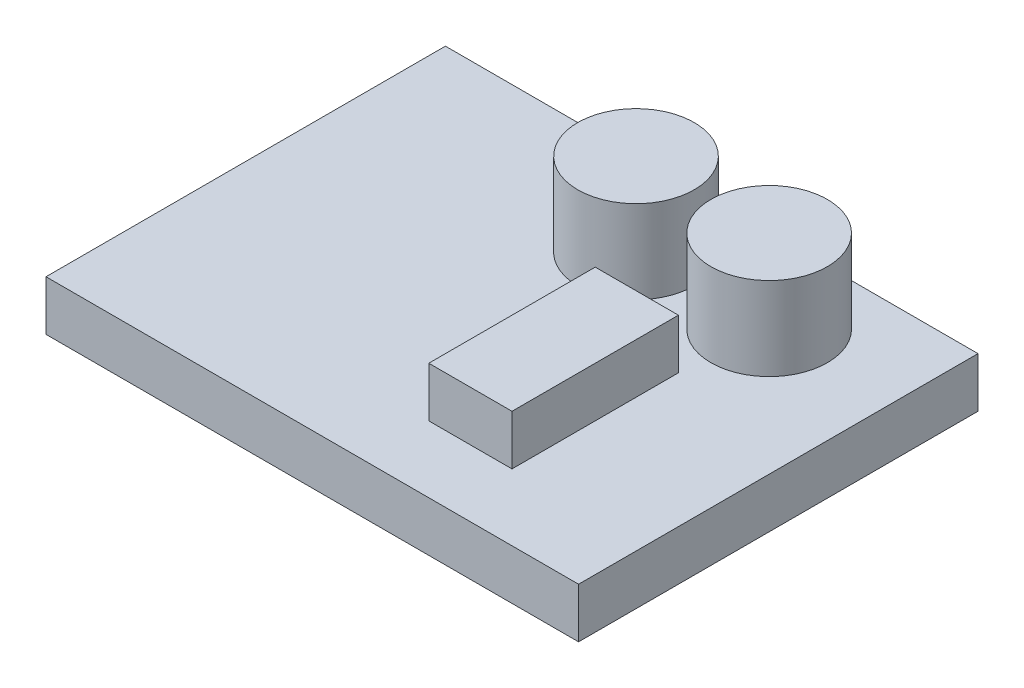
ISO-10303-21;
HEADER;
FILE_DESCRIPTION(('STEP AP214'),'2;1');
FILE_NAME('part.step','',(''),(''),'','','');
FILE_SCHEMA(('AUTOMOTIVE_DESIGN { 1 0 10303 214 1 1 1 1 }'));
ENDSEC;
DATA;
#1=APPLICATION_CONTEXT('core data for automotive mechanical design processes');
#2=APPLICATION_PROTOCOL_DEFINITION('international standard','automotive_design',2000,#1);
#3=PRODUCT_CONTEXT('',#1,'mechanical');
#4=PRODUCT('Part','Part','',(#3));
#5=PRODUCT_RELATED_PRODUCT_CATEGORY('part','',(#4));
#6=PRODUCT_DEFINITION_FORMATION('','',#4);
#7=PRODUCT_DEFINITION_CONTEXT('part definition',#1,'design');
#8=PRODUCT_DEFINITION('design','',#6,#7);
#9=PRODUCT_DEFINITION_SHAPE('','',#8);
#10=(LENGTH_UNIT() NAMED_UNIT(*) SI_UNIT(.MILLI.,.METRE.));
#11=(NAMED_UNIT(*) PLANE_ANGLE_UNIT() SI_UNIT($,.RADIAN.));
#12=(NAMED_UNIT(*) SI_UNIT($,.STERADIAN.) SOLID_ANGLE_UNIT());
#13=UNCERTAINTY_MEASURE_WITH_UNIT(LENGTH_MEASURE(1.E-05),#10,'distance_accuracy_value','');
#14=(GEOMETRIC_REPRESENTATION_CONTEXT(3) GLOBAL_UNCERTAINTY_ASSIGNED_CONTEXT((#13)) GLOBAL_UNIT_ASSIGNED_CONTEXT((#10,
#11,#12)) REPRESENTATION_CONTEXT('',''));
#15=CARTESIAN_POINT('',(0.,0.,0.));
#16=DIRECTION('',(0.,0.,1.));
#17=DIRECTION('',(1.,0.,0.));
#18=AXIS2_PLACEMENT_3D('',#15,#16,#17);
#19=CARTESIAN_POINT('',(0.,3.,0.));
#20=DIRECTION('',(0.,1.,0.));
#21=DIRECTION('',(0.,0.,1.));
#22=AXIS2_PLACEMENT_3D('',#19,#20,#21);
#23=PLANE('',#22);
#24=CARTESIAN_POINT('',(9.07823083781967,3.,-6.52941176470588));
#25=DIRECTION('',(0.,1.,0.));
#26=DIRECTION('',(0.,0.,1.));
#27=AXIS2_PLACEMENT_3D('',#24,#25,#26);
#28=CIRCLE('',#27,3.5);
#29=CARTESIAN_POINT('',(9.07823083781967,3.,-3.02941176470588));
#30=VERTEX_POINT('',#29);
#31=EDGE_CURVE('E132',#30,#30,#28,.T.);
#32=ORIENTED_EDGE('',*,*,#31,.F.);
#33=EDGE_LOOP('',(#32));
#34=FACE_BOUND('',#33,.T.);
#35=DIRECTION('',(0.,0.,1.));
#36=VECTOR('',#35,1.);
#37=CARTESIAN_POINT('',(-15.3725490196078,3.,-11.5294117647059));
#38=LINE('',#37,#36);
#39=CARTESIAN_POINT('',(-15.3725490196078,3.,-11.5294117647059));
#40=VERTEX_POINT('',#39);
#41=CARTESIAN_POINT('',(-15.3725490196078,3.,12.4705882352941));
#42=VERTEX_POINT('',#41);
#43=EDGE_CURVE('E149',#40,#42,#38,.T.);
#44=ORIENTED_EDGE('',*,*,#43,.T.);
#45=DIRECTION('',(1.,0.,0.));
#46=VECTOR('',#45,1.);
#47=CARTESIAN_POINT('',(-15.3725490196078,3.,12.4705882352941));
#48=LINE('',#47,#46);
#49=CARTESIAN_POINT('',(16.6274509803922,3.,12.4705882352941));
#50=VERTEX_POINT('',#49);
#51=EDGE_CURVE('E85',#42,#50,#48,.T.);
#52=ORIENTED_EDGE('',*,*,#51,.T.);
#53=DIRECTION('',(0.,0.,-1.));
#54=VECTOR('',#53,1.);
#55=CARTESIAN_POINT('',(16.6274509803922,3.,-11.5294117647059));
#56=LINE('',#55,#54);
#57=CARTESIAN_POINT('',(16.6274509803922,3.,-11.5294117647059));
#58=VERTEX_POINT('',#57);
#59=EDGE_CURVE('E152',#50,#58,#56,.T.);
#60=ORIENTED_EDGE('',*,*,#59,.T.);
#61=DIRECTION('',(-1.,0.,0.));
#62=VECTOR('',#61,1.);
#63=CARTESIAN_POINT('',(-15.3725490196078,3.,-11.5294117647059));
#64=LINE('',#63,#62);
#65=EDGE_CURVE('E57',#58,#40,#64,.T.);
#66=ORIENTED_EDGE('',*,*,#65,.T.);
#67=EDGE_LOOP('',(#44,#52,#60,#66));
#68=FACE_BOUND('',#67,.T.);
#69=CARTESIAN_POINT('',(1.07823083781967,3.,-6.52941176470588));
#70=DIRECTION('',(0.,1.,0.));
#71=DIRECTION('',(0.,0.,1.));
#72=AXIS2_PLACEMENT_3D('',#69,#70,#71);
#73=CIRCLE('',#72,3.5);
#74=CARTESIAN_POINT('',(1.07823083781967,3.,-3.02941176470588));
#75=VERTEX_POINT('',#74);
#76=EDGE_CURVE('E141',#75,#75,#73,.T.);
#77=ORIENTED_EDGE('',*,*,#76,.F.);
#78=EDGE_LOOP('',(#77));
#79=FACE_BOUND('',#78,.T.);
#80=DIRECTION('',(1.,0.,0.));
#81=VECTOR('',#80,1.);
#82=CARTESIAN_POINT('',(3.62745098039218,3.,8.47058823529412));
#83=LINE('',#82,#81);
#84=CARTESIAN_POINT('',(3.62745098039218,3.,8.47058823529412));
#85=VERTEX_POINT('',#84);
#86=CARTESIAN_POINT('',(8.62745098039217,3.,8.47058823529412));
#87=VERTEX_POINT('',#86);
#88=EDGE_CURVE('E317',#85,#87,#83,.T.);
#89=ORIENTED_EDGE('',*,*,#88,.F.);
#90=DIRECTION('',(0.,0.,1.));
#91=VECTOR('',#90,1.);
#92=CARTESIAN_POINT('',(3.62745098039217,3.,-1.52941176470588));
#93=LINE('',#92,#91);
#94=CARTESIAN_POINT('',(3.62745098039217,3.,-1.52941176470588));
#95=VERTEX_POINT('',#94);
#96=EDGE_CURVE('E130',#95,#85,#93,.T.);
#97=ORIENTED_EDGE('',*,*,#96,.F.);
#98=DIRECTION('',(-1.,0.,0.));
#99=VECTOR('',#98,1.);
#100=CARTESIAN_POINT('',(3.62745098039217,3.,-1.52941176470588));
#101=LINE('',#100,#99);
#102=CARTESIAN_POINT('',(8.62745098039217,3.,-1.52941176470588));
#103=VERTEX_POINT('',#102);
#104=EDGE_CURVE('E126',#103,#95,#101,.T.);
#105=ORIENTED_EDGE('',*,*,#104,.F.);
#106=DIRECTION('',(0.,0.,-1.));
#107=VECTOR('',#106,1.);
#108=CARTESIAN_POINT('',(8.62745098039217,3.,-1.52941176470588));
#109=LINE('',#108,#107);
#110=EDGE_CURVE('E314',#87,#103,#109,.T.);
#111=ORIENTED_EDGE('',*,*,#110,.F.);
#112=EDGE_LOOP('',(#89,#97,#105,#111));
#113=FACE_BOUND('',#112,.T.);
#114=ADVANCED_FACE('F33',(#34,#68,#79,#113),#23,.T.);
#115=CARTESIAN_POINT('',(-15.3725490196078,3.,-11.5294117647059));
#116=DIRECTION('',(1.,0.,0.));
#117=DIRECTION('',(0.,0.,-1.));
#118=AXIS2_PLACEMENT_3D('',#115,#116,#117);
#119=PLANE('',#118);
#120=DIRECTION('',(0.,0.,1.));
#121=VECTOR('',#120,1.);
#122=CARTESIAN_POINT('',(-15.3725490196078,0.,-11.5294117647059));
#123=LINE('',#122,#121);
#124=CARTESIAN_POINT('',(-15.3725490196078,0.,-11.5294117647059));
#125=VERTEX_POINT('',#124);
#126=CARTESIAN_POINT('',(-15.3725490196078,0.,12.4705882352941));
#127=VERTEX_POINT('',#126);
#128=EDGE_CURVE('E146',#125,#127,#123,.T.);
#129=ORIENTED_EDGE('',*,*,#128,.T.);
#130=DIRECTION('',(0.,-1.,0.));
#131=VECTOR('',#130,1.);
#132=CARTESIAN_POINT('',(-15.3725490196078,3.,12.4705882352941));
#133=LINE('',#132,#131);
#134=EDGE_CURVE('E11',#42,#127,#133,.T.);
#135=ORIENTED_EDGE('',*,*,#134,.F.);
#136=ORIENTED_EDGE('',*,*,#43,.F.);
#137=DIRECTION('',(0.,-1.,0.));
#138=VECTOR('',#137,1.);
#139=CARTESIAN_POINT('',(-15.3725490196078,3.,-11.5294117647059));
#140=LINE('',#139,#138);
#141=EDGE_CURVE('E155',#40,#125,#140,.T.);
#142=ORIENTED_EDGE('',*,*,#141,.T.);
#143=EDGE_LOOP('',(#129,#135,#136,#142));
#144=FACE_BOUND('',#143,.T.);
#145=ADVANCED_FACE('F35',(#144),#119,.F.);
#146=CARTESIAN_POINT('',(-15.3725490196078,3.,12.4705882352941));
#147=DIRECTION('',(0.,0.,-1.));
#148=DIRECTION('',(-1.,0.,0.));
#149=AXIS2_PLACEMENT_3D('',#146,#147,#148);
#150=PLANE('',#149);
#151=DIRECTION('',(1.,0.,0.));
#152=VECTOR('',#151,1.);
#153=CARTESIAN_POINT('',(-15.3725490196078,0.,12.4705882352941));
#154=LINE('',#153,#152);
#155=CARTESIAN_POINT('',(16.6274509803922,0.,12.4705882352941));
#156=VERTEX_POINT('',#155);
#157=EDGE_CURVE('E158',#127,#156,#154,.T.);
#158=ORIENTED_EDGE('',*,*,#157,.T.);
#159=DIRECTION('',(0.,-1.,0.));
#160=VECTOR('',#159,1.);
#161=CARTESIAN_POINT('',(16.6274509803922,3.,12.4705882352941));
#162=LINE('',#161,#160);
#163=EDGE_CURVE('E41',#50,#156,#162,.T.);
#164=ORIENTED_EDGE('',*,*,#163,.F.);
#165=ORIENTED_EDGE('',*,*,#51,.F.);
#166=ORIENTED_EDGE('',*,*,#134,.T.);
#167=EDGE_LOOP('',(#158,#164,#165,#166));
#168=FACE_BOUND('',#167,.T.);
#169=ADVANCED_FACE('F186',(#168),#150,.F.);
#170=CARTESIAN_POINT('',(16.6274509803922,3.,-11.5294117647059));
#171=DIRECTION('',(-1.,0.,0.));
#172=DIRECTION('',(0.,0.,1.));
#173=AXIS2_PLACEMENT_3D('',#170,#171,#172);
#174=PLANE('',#173);
#175=DIRECTION('',(0.,0.,-1.));
#176=VECTOR('',#175,1.);
#177=CARTESIAN_POINT('',(16.6274509803922,0.,-11.5294117647059));
#178=LINE('',#177,#176);
#179=CARTESIAN_POINT('',(16.6274509803922,0.,-11.5294117647059));
#180=VERTEX_POINT('',#179);
#181=EDGE_CURVE('E160',#156,#180,#178,.T.);
#182=ORIENTED_EDGE('',*,*,#181,.T.);
#183=DIRECTION('',(0.,-1.,0.));
#184=VECTOR('',#183,1.);
#185=CARTESIAN_POINT('',(16.6274509803922,3.,-11.5294117647059));
#186=LINE('',#185,#184);
#187=EDGE_CURVE('E164',#58,#180,#186,.T.);
#188=ORIENTED_EDGE('',*,*,#187,.F.);
#189=ORIENTED_EDGE('',*,*,#59,.F.);
#190=ORIENTED_EDGE('',*,*,#163,.T.);
#191=EDGE_LOOP('',(#182,#188,#189,#190));
#192=FACE_BOUND('',#191,.T.);
#193=ADVANCED_FACE('F169',(#192),#174,.F.);
#194=CARTESIAN_POINT('',(-15.3725490196078,3.,-11.5294117647059));
#195=DIRECTION('',(0.,0.,1.));
#196=DIRECTION('',(1.,0.,0.));
#197=AXIS2_PLACEMENT_3D('',#194,#195,#196);
#198=PLANE('',#197);
#199=DIRECTION('',(-1.,0.,0.));
#200=VECTOR('',#199,1.);
#201=CARTESIAN_POINT('',(-15.3725490196078,0.,-11.5294117647059));
#202=LINE('',#201,#200);
#203=EDGE_CURVE('E78',#180,#125,#202,.T.);
#204=ORIENTED_EDGE('',*,*,#203,.T.);
#205=ORIENTED_EDGE('',*,*,#141,.F.);
#206=ORIENTED_EDGE('',*,*,#65,.F.);
#207=ORIENTED_EDGE('',*,*,#187,.T.);
#208=EDGE_LOOP('',(#204,#205,#206,#207));
#209=FACE_BOUND('',#208,.T.);
#210=ADVANCED_FACE('F177',(#209),#198,.F.);
#211=CARTESIAN_POINT('',(0.,0.,0.));
#212=DIRECTION('',(0.,1.,0.));
#213=DIRECTION('',(0.,0.,1.));
#214=AXIS2_PLACEMENT_3D('',#211,#212,#213);
#215=PLANE('',#214);
#216=ORIENTED_EDGE('',*,*,#128,.F.);
#217=ORIENTED_EDGE('',*,*,#203,.F.);
#218=ORIENTED_EDGE('',*,*,#181,.F.);
#219=ORIENTED_EDGE('',*,*,#157,.F.);
#220=EDGE_LOOP('',(#216,#217,#218,#219));
#221=FACE_BOUND('',#220,.T.);
#222=ADVANCED_FACE('F173',(#221),#215,.F.);
#223=CARTESIAN_POINT('',(1.07823083781967,8.,-6.52941176470588));
#224=DIRECTION('',(0.,-1.,0.));
#225=DIRECTION('',(0.,0.,-1.));
#226=AXIS2_PLACEMENT_3D('',#223,#224,#225);
#227=CYLINDRICAL_SURFACE('',#226,3.5);
#228=CARTESIAN_POINT('',(1.07823083781967,8.,-6.52941176470588));
#229=DIRECTION('',(0.,1.,0.));
#230=DIRECTION('',(0.,0.,1.));
#231=AXIS2_PLACEMENT_3D('',#228,#229,#230);
#232=CIRCLE('',#231,3.5);
#233=CARTESIAN_POINT('',(1.07823083781967,8.,-3.02941176470588));
#234=VERTEX_POINT('',#233);
#235=EDGE_CURVE('E143',#234,#234,#232,.T.);
#236=ORIENTED_EDGE('',*,*,#235,.F.);
#237=EDGE_LOOP('',(#236));
#238=FACE_BOUND('',#237,.T.);
#239=ORIENTED_EDGE('',*,*,#76,.T.);
#240=EDGE_LOOP('',(#239));
#241=FACE_BOUND('',#240,.T.);
#242=ADVANCED_FACE('F184',(#238,#241),#227,.T.);
#243=CARTESIAN_POINT('',(1.07823083781967,8.,-6.52941176470588));
#244=DIRECTION('',(0.,1.,0.));
#245=DIRECTION('',(0.,0.,1.));
#246=AXIS2_PLACEMENT_3D('',#243,#244,#245);
#247=PLANE('',#246);
#248=ORIENTED_EDGE('',*,*,#235,.T.);
#249=EDGE_LOOP('',(#248));
#250=FACE_BOUND('',#249,.T.);
#251=ADVANCED_FACE('F198',(#250),#247,.T.);
#252=CARTESIAN_POINT('',(9.07823083781967,8.,-6.52941176470588));
#253=DIRECTION('',(0.,-1.,0.));
#254=DIRECTION('',(0.,0.,-1.));
#255=AXIS2_PLACEMENT_3D('',#252,#253,#254);
#256=CYLINDRICAL_SURFACE('',#255,3.5);
#257=CARTESIAN_POINT('',(9.07823083781967,8.,-6.52941176470588));
#258=DIRECTION('',(0.,1.,0.));
#259=DIRECTION('',(0.,0.,1.));
#260=AXIS2_PLACEMENT_3D('',#257,#258,#259);
#261=CIRCLE('',#260,3.5);
#262=CARTESIAN_POINT('',(9.07823083781967,8.,-3.02941176470588));
#263=VERTEX_POINT('',#262);
#264=EDGE_CURVE('E135',#263,#263,#261,.T.);
#265=ORIENTED_EDGE('',*,*,#264,.F.);
#266=EDGE_LOOP('',(#265));
#267=FACE_BOUND('',#266,.T.);
#268=ORIENTED_EDGE('',*,*,#31,.T.);
#269=EDGE_LOOP('',(#268));
#270=FACE_BOUND('',#269,.T.);
#271=ADVANCED_FACE('F202',(#267,#270),#256,.T.);
#272=CARTESIAN_POINT('',(9.07823083781967,8.,-6.52941176470588));
#273=DIRECTION('',(0.,1.,0.));
#274=DIRECTION('',(0.,0.,1.));
#275=AXIS2_PLACEMENT_3D('',#272,#273,#274);
#276=PLANE('',#275);
#277=ORIENTED_EDGE('',*,*,#264,.T.);
#278=EDGE_LOOP('',(#277));
#279=FACE_BOUND('',#278,.T.);
#280=ADVANCED_FACE('F206',(#279),#276,.T.);
#281=CARTESIAN_POINT('',(3.62745098039217,6.,-1.52941176470588));
#282=DIRECTION('',(1.,0.,0.));
#283=DIRECTION('',(0.,0.,-1.));
#284=AXIS2_PLACEMENT_3D('',#281,#282,#283);
#285=PLANE('',#284);
#286=ORIENTED_EDGE('',*,*,#96,.T.);
#287=DIRECTION('',(0.,-1.,0.));
#288=VECTOR('',#287,1.);
#289=CARTESIAN_POINT('',(3.62745098039218,6.,8.47058823529412));
#290=LINE('',#289,#288);
#291=CARTESIAN_POINT('',(3.62745098039218,6.,8.47058823529412));
#292=VERTEX_POINT('',#291);
#293=EDGE_CURVE('E111',#292,#85,#290,.T.);
#294=ORIENTED_EDGE('',*,*,#293,.F.);
#295=DIRECTION('',(0.,0.,1.));
#296=VECTOR('',#295,1.);
#297=CARTESIAN_POINT('',(3.62745098039217,6.,-1.52941176470588));
#298=LINE('',#297,#296);
#299=CARTESIAN_POINT('',(3.62745098039217,6.,-1.52941176470588));
#300=VERTEX_POINT('',#299);
#301=EDGE_CURVE('E118',#300,#292,#298,.T.);
#302=ORIENTED_EDGE('',*,*,#301,.F.);
#303=DIRECTION('',(0.,-1.,0.));
#304=VECTOR('',#303,1.);
#305=CARTESIAN_POINT('',(3.62745098039217,6.,-1.52941176470588));
#306=LINE('',#305,#304);
#307=EDGE_CURVE('E311',#300,#95,#306,.T.);
#308=ORIENTED_EDGE('',*,*,#307,.T.);
#309=EDGE_LOOP('',(#286,#294,#302,#308));
#310=FACE_BOUND('',#309,.T.);
#311=ADVANCED_FACE('F128',(#310),#285,.F.);
#312=CARTESIAN_POINT('',(3.62745098039218,6.,8.47058823529412));
#313=DIRECTION('',(0.,0.,-1.));
#314=DIRECTION('',(-1.,0.,0.));
#315=AXIS2_PLACEMENT_3D('',#312,#313,#314);
#316=PLANE('',#315);
#317=ORIENTED_EDGE('',*,*,#88,.T.);
#318=DIRECTION('',(0.,-1.,0.));
#319=VECTOR('',#318,1.);
#320=CARTESIAN_POINT('',(8.62745098039217,6.,8.47058823529412));
#321=LINE('',#320,#319);
#322=CARTESIAN_POINT('',(8.62745098039217,6.,8.47058823529412));
#323=VERTEX_POINT('',#322);
#324=EDGE_CURVE('E114',#323,#87,#321,.T.);
#325=ORIENTED_EDGE('',*,*,#324,.F.);
#326=DIRECTION('',(1.,0.,0.));
#327=VECTOR('',#326,1.);
#328=CARTESIAN_POINT('',(3.62745098039218,6.,8.47058823529412));
#329=LINE('',#328,#327);
#330=EDGE_CURVE('E107',#292,#323,#329,.T.);
#331=ORIENTED_EDGE('',*,*,#330,.F.);
#332=ORIENTED_EDGE('',*,*,#293,.T.);
#333=EDGE_LOOP('',(#317,#325,#331,#332));
#334=FACE_BOUND('',#333,.T.);
#335=ADVANCED_FACE('F109',(#334),#316,.F.);
#336=CARTESIAN_POINT('',(8.62745098039217,6.,-1.52941176470588));
#337=DIRECTION('',(-1.,0.,0.));
#338=DIRECTION('',(0.,0.,1.));
#339=AXIS2_PLACEMENT_3D('',#336,#337,#338);
#340=PLANE('',#339);
#341=ORIENTED_EDGE('',*,*,#110,.T.);
#342=DIRECTION('',(0.,-1.,0.));
#343=VECTOR('',#342,1.);
#344=CARTESIAN_POINT('',(8.62745098039217,6.,-1.52941176470588));
#345=LINE('',#344,#343);
#346=CARTESIAN_POINT('',(8.62745098039217,6.,-1.52941176470588));
#347=VERTEX_POINT('',#346);
#348=EDGE_CURVE('E48',#347,#103,#345,.T.);
#349=ORIENTED_EDGE('',*,*,#348,.F.);
#350=DIRECTION('',(0.,0.,-1.));
#351=VECTOR('',#350,1.);
#352=CARTESIAN_POINT('',(8.62745098039217,6.,-1.52941176470588));
#353=LINE('',#352,#351);
#354=EDGE_CURVE('E117',#323,#347,#353,.T.);
#355=ORIENTED_EDGE('',*,*,#354,.F.);
#356=ORIENTED_EDGE('',*,*,#324,.T.);
#357=EDGE_LOOP('',(#341,#349,#355,#356));
#358=FACE_BOUND('',#357,.T.);
#359=ADVANCED_FACE('F215',(#358),#340,.F.);
#360=CARTESIAN_POINT('',(3.62745098039217,6.,-1.52941176470588));
#361=DIRECTION('',(0.,0.,1.));
#362=DIRECTION('',(1.,0.,0.));
#363=AXIS2_PLACEMENT_3D('',#360,#361,#362);
#364=PLANE('',#363);
#365=ORIENTED_EDGE('',*,*,#104,.T.);
#366=ORIENTED_EDGE('',*,*,#307,.F.);
#367=DIRECTION('',(-1.,0.,0.));
#368=VECTOR('',#367,1.);
#369=CARTESIAN_POINT('',(3.62745098039217,6.,-1.52941176470588));
#370=LINE('',#369,#368);
#371=EDGE_CURVE('E122',#347,#300,#370,.T.);
#372=ORIENTED_EDGE('',*,*,#371,.F.);
#373=ORIENTED_EDGE('',*,*,#348,.T.);
#374=EDGE_LOOP('',(#365,#366,#372,#373));
#375=FACE_BOUND('',#374,.T.);
#376=ADVANCED_FACE('F218',(#375),#364,.F.);
#377=CARTESIAN_POINT('',(0.,6.,0.));
#378=DIRECTION('',(0.,1.,0.));
#379=DIRECTION('',(0.,0.,1.));
#380=AXIS2_PLACEMENT_3D('',#377,#378,#379);
#381=PLANE('',#380);
#382=ORIENTED_EDGE('',*,*,#301,.T.);
#383=ORIENTED_EDGE('',*,*,#330,.T.);
#384=ORIENTED_EDGE('',*,*,#354,.T.);
#385=ORIENTED_EDGE('',*,*,#371,.T.);
#386=EDGE_LOOP('',(#382,#383,#384,#385));
#387=FACE_BOUND('',#386,.T.);
#388=ADVANCED_FACE('F121',(#387),#381,.T.);
#389=CLOSED_SHELL('',(#114,#145,#169,#193,#210,#222,#242,#251,#271,#280,#311,#335,#359,#376,#388));
#390=MANIFOLD_SOLID_BREP('B2',#389);
#391=ADVANCED_BREP_SHAPE_REPRESENTATION('',(#18,#390),#14);
#392=SHAPE_DEFINITION_REPRESENTATION(#9,#391);
ENDSEC;
END-ISO-10303-21;
